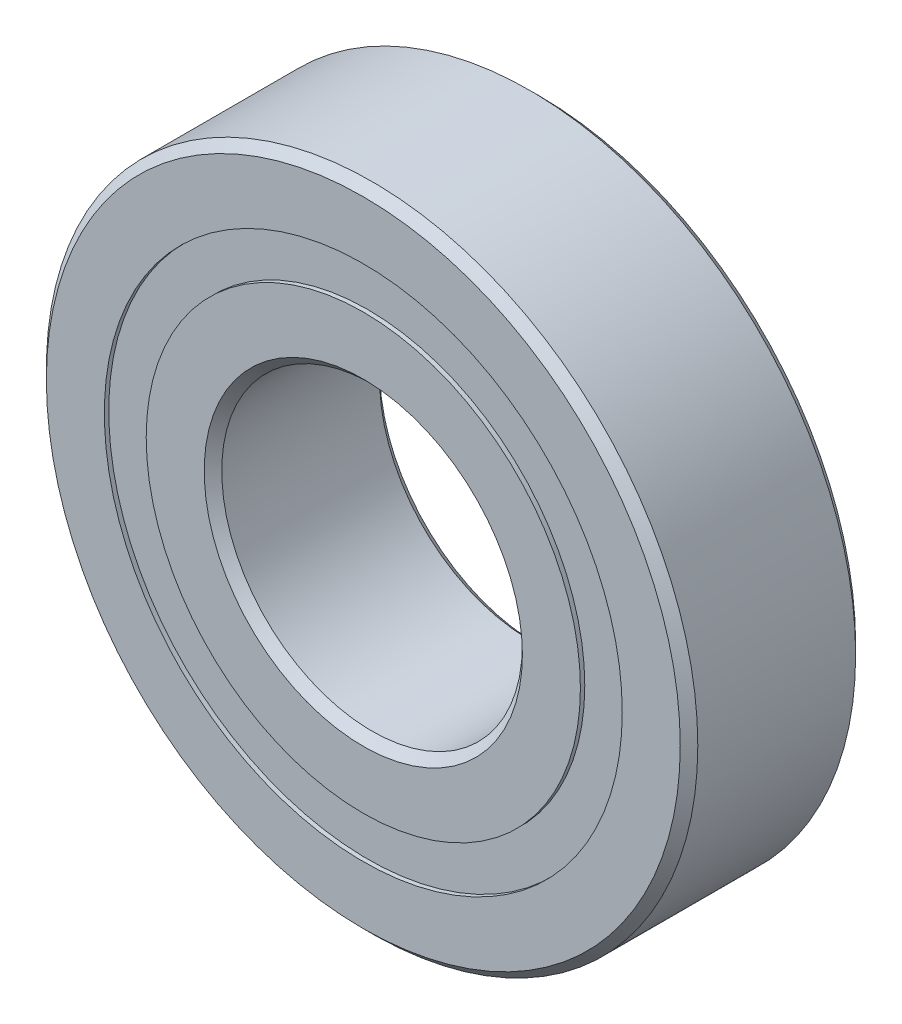
ISO-10303-21;
HEADER;
FILE_DESCRIPTION(('STEP AP214'),'2;1');
FILE_NAME('part.step','',(''),(''),'','','');
FILE_SCHEMA(('AUTOMOTIVE_DESIGN { 1 0 10303 214 1 1 1 1 }'));
ENDSEC;
DATA;
#1=APPLICATION_CONTEXT('core data for automotive mechanical design processes');
#2=APPLICATION_PROTOCOL_DEFINITION('international standard','automotive_design',2000,#1);
#3=PRODUCT_CONTEXT('',#1,'mechanical');
#4=PRODUCT('Part','Part','',(#3));
#5=PRODUCT_RELATED_PRODUCT_CATEGORY('part','',(#4));
#6=PRODUCT_DEFINITION_FORMATION('','',#4);
#7=PRODUCT_DEFINITION_CONTEXT('part definition',#1,'design');
#8=PRODUCT_DEFINITION('design','',#6,#7);
#9=PRODUCT_DEFINITION_SHAPE('','',#8);
#10=(LENGTH_UNIT() NAMED_UNIT(*) SI_UNIT(.MILLI.,.METRE.));
#11=(NAMED_UNIT(*) PLANE_ANGLE_UNIT() SI_UNIT($,.RADIAN.));
#12=(NAMED_UNIT(*) SI_UNIT($,.STERADIAN.) SOLID_ANGLE_UNIT());
#13=UNCERTAINTY_MEASURE_WITH_UNIT(LENGTH_MEASURE(1.E-05),#10,'distance_accuracy_value','');
#14=(GEOMETRIC_REPRESENTATION_CONTEXT(3) GLOBAL_UNCERTAINTY_ASSIGNED_CONTEXT((#13)) GLOBAL_UNIT_ASSIGNED_CONTEXT((#10,
#11,#12)) REPRESENTATION_CONTEXT('',''));
#15=CARTESIAN_POINT('',(0.,0.,0.));
#16=DIRECTION('',(0.,0.,1.));
#17=DIRECTION('',(1.,0.,0.));
#18=AXIS2_PLACEMENT_3D('',#15,#16,#17);
#19=CARTESIAN_POINT('',(0.,16.4070741758242,-5.2784375));
#20=DIRECTION('',(0.,0.,1.));
#21=DIRECTION('',(1.,0.,0.));
#22=AXIS2_PLACEMENT_3D('',#19,#20,#21);
#23=PLANE('',#22);
#24=CARTESIAN_POINT('',(0.,0.,-5.2784375));
#25=DIRECTION('',(0.,0.,1.));
#26=DIRECTION('',(1.,0.,0.));
#27=AXIS2_PLACEMENT_3D('',#24,#25,#26);
#28=CIRCLE('',#27,16.4070741758242);
#29=CARTESIAN_POINT('',(16.4070741758242,0.,-5.2784375));
#30=VERTEX_POINT('',#29);
#31=EDGE_CURVE('E55',#30,#30,#28,.T.);
#32=ORIENTED_EDGE('',*,*,#31,.F.);
#33=EDGE_LOOP('',(#32));
#34=FACE_BOUND('',#33,.T.);
#35=CARTESIAN_POINT('',(0.,0.,-5.2784375));
#36=DIRECTION('',(0.,0.,1.));
#37=DIRECTION('',(1.,0.,0.));
#38=AXIS2_PLACEMENT_3D('',#35,#36,#37);
#39=CIRCLE('',#38,13.7554258241758);
#40=CARTESIAN_POINT('',(13.7554258241758,0.,-5.2784375));
#41=VERTEX_POINT('',#40);
#42=EDGE_CURVE('E11',#41,#41,#39,.T.);
#43=ORIENTED_EDGE('',*,*,#42,.T.);
#44=EDGE_LOOP('',(#43));
#45=FACE_BOUND('',#44,.T.);
#46=ADVANCED_FACE('F41',(#34,#45),#23,.F.);
#47=CARTESIAN_POINT('',(0.,0.,5.55625));
#48=DIRECTION('',(0.,0.,1.));
#49=DIRECTION('',(1.,0.,0.));
#50=AXIS2_PLACEMENT_3D('',#47,#48,#49);
#51=CYLINDRICAL_SURFACE('',#50,13.7554258241758);
#52=ORIENTED_EDGE('',*,*,#42,.F.);
#53=EDGE_LOOP('',(#52));
#54=FACE_BOUND('',#53,.T.);
#55=CARTESIAN_POINT('',(0.,0.,-2.80284955168796));
#56=DIRECTION('',(0.,0.,1.));
#57=DIRECTION('',(1.,0.,0.));
#58=AXIS2_PLACEMENT_3D('',#55,#56,#57);
#59=CIRCLE('',#58,13.7554258241758);
#60=CARTESIAN_POINT('',(13.7554258241758,0.,-2.80284955168796));
#61=VERTEX_POINT('',#60);
#62=EDGE_CURVE('E47',#61,#61,#59,.T.);
#63=ORIENTED_EDGE('',*,*,#62,.T.);
#64=EDGE_LOOP('',(#63));
#65=FACE_BOUND('',#64,.T.);
#66=ADVANCED_FACE('F64',(#54,#65),#51,.F.);
#67=CARTESIAN_POINT('',(0.,16.4070741758242,-2.80284955168796));
#68=DIRECTION('',(0.,0.,-1.));
#69=DIRECTION('',(-1.,0.,0.));
#70=AXIS2_PLACEMENT_3D('',#67,#68,#69);
#71=PLANE('',#70);
#72=ORIENTED_EDGE('',*,*,#62,.F.);
#73=EDGE_LOOP('',(#72));
#74=FACE_BOUND('',#73,.T.);
#75=CARTESIAN_POINT('',(0.,0.,-2.80284955168796));
#76=DIRECTION('',(0.,0.,1.));
#77=DIRECTION('',(1.,0.,0.));
#78=AXIS2_PLACEMENT_3D('',#75,#76,#77);
#79=CIRCLE('',#78,16.4070741758242);
#80=CARTESIAN_POINT('',(16.4070741758242,0.,-2.80284955168796));
#81=VERTEX_POINT('',#80);
#82=EDGE_CURVE('E51',#81,#81,#79,.T.);
#83=ORIENTED_EDGE('',*,*,#82,.T.);
#84=EDGE_LOOP('',(#83));
#85=FACE_BOUND('',#84,.T.);
#86=ADVANCED_FACE('F68',(#74,#85),#71,.F.);
#87=CARTESIAN_POINT('',(0.,0.,5.55625));
#88=DIRECTION('',(0.,0.,1.));
#89=DIRECTION('',(1.,0.,0.));
#90=AXIS2_PLACEMENT_3D('',#87,#88,#89);
#91=CYLINDRICAL_SURFACE('',#90,16.4070741758242);
#92=ORIENTED_EDGE('',*,*,#82,.F.);
#93=EDGE_LOOP('',(#92));
#94=FACE_BOUND('',#93,.T.);
#95=ORIENTED_EDGE('',*,*,#31,.T.);
#96=EDGE_LOOP('',(#95));
#97=FACE_BOUND('',#96,.T.);
#98=ADVANCED_FACE('F61',(#94,#97),#91,.T.);
#99=CLOSED_SHELL('',(#46,#66,#86,#98));
#100=MANIFOLD_SOLID_BREP('B2',#99);
#101=CARTESIAN_POINT('',(0.,16.4070741758242,5.2784375));
#102=DIRECTION('',(0.,0.,-1.));
#103=DIRECTION('',(-1.,0.,0.));
#104=AXIS2_PLACEMENT_3D('',#101,#102,#103);
#105=PLANE('',#104);
#106=CARTESIAN_POINT('',(0.,0.,5.2784375));
#107=DIRECTION('',(0.,0.,1.));
#108=DIRECTION('',(1.,0.,0.));
#109=AXIS2_PLACEMENT_3D('',#106,#107,#108);
#110=CIRCLE('',#109,13.7554258241758);
#111=CARTESIAN_POINT('',(13.7554258241758,0.,5.2784375));
#112=VERTEX_POINT('',#111);
#113=EDGE_CURVE('E40',#112,#112,#110,.T.);
#114=ORIENTED_EDGE('',*,*,#113,.F.);
#115=EDGE_LOOP('',(#114));
#116=FACE_BOUND('',#115,.T.);
#117=CARTESIAN_POINT('',(0.,0.,5.2784375));
#118=DIRECTION('',(0.,0.,1.));
#119=DIRECTION('',(1.,0.,0.));
#120=AXIS2_PLACEMENT_3D('',#117,#118,#119);
#121=CIRCLE('',#120,16.4070741758242);
#122=CARTESIAN_POINT('',(16.4070741758242,0.,5.2784375));
#123=VERTEX_POINT('',#122);
#124=EDGE_CURVE('E122',#123,#123,#121,.T.);
#125=ORIENTED_EDGE('',*,*,#124,.T.);
#126=EDGE_LOOP('',(#125));
#127=FACE_BOUND('',#126,.T.);
#128=ADVANCED_FACE('F108',(#116,#127),#105,.F.);
#129=CARTESIAN_POINT('',(0.,0.,5.55625));
#130=DIRECTION('',(0.,0.,1.));
#131=DIRECTION('',(1.,0.,0.));
#132=AXIS2_PLACEMENT_3D('',#129,#130,#131);
#133=CYLINDRICAL_SURFACE('',#132,13.7554258241758);
#134=CARTESIAN_POINT('',(0.,0.,2.80284955168796));
#135=DIRECTION('',(0.,0.,1.));
#136=DIRECTION('',(1.,0.,0.));
#137=AXIS2_PLACEMENT_3D('',#134,#135,#136);
#138=CIRCLE('',#137,13.7554258241758);
#139=CARTESIAN_POINT('',(13.7554258241758,0.,2.80284955168796));
#140=VERTEX_POINT('',#139);
#141=EDGE_CURVE('E114',#140,#140,#138,.T.);
#142=ORIENTED_EDGE('',*,*,#141,.F.);
#143=EDGE_LOOP('',(#142));
#144=FACE_BOUND('',#143,.T.);
#145=ORIENTED_EDGE('',*,*,#113,.T.);
#146=EDGE_LOOP('',(#145));
#147=FACE_BOUND('',#146,.T.);
#148=ADVANCED_FACE('F137',(#144,#147),#133,.F.);
#149=CARTESIAN_POINT('',(0.,16.4070741758242,2.80284955168796));
#150=DIRECTION('',(0.,0.,1.));
#151=DIRECTION('',(1.,0.,0.));
#152=AXIS2_PLACEMENT_3D('',#149,#150,#151);
#153=PLANE('',#152);
#154=CARTESIAN_POINT('',(0.,0.,2.80284955168796));
#155=DIRECTION('',(0.,0.,1.));
#156=DIRECTION('',(1.,0.,0.));
#157=AXIS2_PLACEMENT_3D('',#154,#155,#156);
#158=CIRCLE('',#157,16.4070741758242);
#159=CARTESIAN_POINT('',(16.4070741758242,0.,2.80284955168796));
#160=VERTEX_POINT('',#159);
#161=EDGE_CURVE('E118',#160,#160,#158,.T.);
#162=ORIENTED_EDGE('',*,*,#161,.F.);
#163=EDGE_LOOP('',(#162));
#164=FACE_BOUND('',#163,.T.);
#165=ORIENTED_EDGE('',*,*,#141,.T.);
#166=EDGE_LOOP('',(#165));
#167=FACE_BOUND('',#166,.T.);
#168=ADVANCED_FACE('F132',(#164,#167),#153,.F.);
#169=CARTESIAN_POINT('',(0.,0.,5.55625));
#170=DIRECTION('',(0.,0.,1.));
#171=DIRECTION('',(1.,0.,0.));
#172=AXIS2_PLACEMENT_3D('',#169,#170,#171);
#173=CYLINDRICAL_SURFACE('',#172,16.4070741758242);
#174=ORIENTED_EDGE('',*,*,#124,.F.);
#175=EDGE_LOOP('',(#174));
#176=FACE_BOUND('',#175,.T.);
#177=ORIENTED_EDGE('',*,*,#161,.T.);
#178=EDGE_LOOP('',(#177));
#179=FACE_BOUND('',#178,.T.);
#180=ADVANCED_FACE('F129',(#176,#179),#173,.T.);
#181=CLOSED_SHELL('',(#128,#148,#168,#180));
#182=MANIFOLD_SOLID_BREP('B6',#181);
#183=CARTESIAN_POINT('',(-8.8645363361357,12.2009875464173,0.));
#184=DIRECTION('',(0.,0.,1.));
#185=DIRECTION('',(-0.587785252292462,0.809016994374955,0.));
#186=AXIS2_PLACEMENT_3D('',#183,#184,#185);
#187=SPHERICAL_SURFACE('',#186,2.80284955168796);
#188=CARTESIAN_POINT('',(-8.8645363361357,12.2009875464173,2.80284955168796));
#189=VERTEX_POINT('',#188);
#190=VERTEX_LOOP('',#189);
#191=FACE_BOUND('',#190,.T.);
#192=ADVANCED_FACE('F175',(#191),#187,.T.);
#193=CLOSED_SHELL('',(#192));
#194=MANIFOLD_SOLID_BREP('B35',#193);
#195=CARTESIAN_POINT('',(-14.3431210863762,4.66036254641734,0.));
#196=DIRECTION('',(0.,0.,1.));
#197=DIRECTION('',(-0.95105651629515,0.309016994374958,0.));
#198=AXIS2_PLACEMENT_3D('',#195,#196,#197);
#199=SPHERICAL_SURFACE('',#198,2.80284955168796);
#200=CARTESIAN_POINT('',(-14.3431210863762,4.66036254641734,2.80284955168796));
#201=VERTEX_POINT('',#200);
#202=VERTEX_LOOP('',#201);
#203=FACE_BOUND('',#202,.T.);
#204=ADVANCED_FACE('F195',(#203),#199,.T.);
#205=CLOSED_SHELL('',(#204));
#206=MANIFOLD_SOLID_BREP('B104',#205);
#207=CARTESIAN_POINT('',(-14.3431210863763,-4.66036254641704,0.));
#208=DIRECTION('',(0.,0.,1.));
#209=DIRECTION('',(-0.951056516295157,-0.309016994374938,0.));
#210=AXIS2_PLACEMENT_3D('',#207,#208,#209);
#211=SPHERICAL_SURFACE('',#210,2.80284955168796);
#212=CARTESIAN_POINT('',(-14.3431210863763,-4.66036254641704,2.80284955168796));
#213=VERTEX_POINT('',#212);
#214=VERTEX_LOOP('',#213);
#215=FACE_BOUND('',#214,.T.);
#216=ADVANCED_FACE('F215',(#215),#211,.T.);
#217=CLOSED_SHELL('',(#216));
#218=MANIFOLD_SOLID_BREP('B171',#217);
#219=CARTESIAN_POINT('',(-8.86453633613597,-12.2009875464171,0.));
#220=DIRECTION('',(0.,0.,1.));
#221=DIRECTION('',(-0.58778525229248,-0.809016994374942,0.));
#222=AXIS2_PLACEMENT_3D('',#219,#220,#221);
#223=SPHERICAL_SURFACE('',#222,2.80284955168796);
#224=CARTESIAN_POINT('',(-8.86453633613597,-12.2009875464171,2.80284955168796));
#225=VERTEX_POINT('',#224);
#226=VERTEX_LOOP('',#225);
#227=FACE_BOUND('',#226,.T.);
#228=ADVANCED_FACE('F235',(#227),#223,.T.);
#229=CLOSED_SHELL('',(#228));
#230=MANIFOLD_SOLID_BREP('B191',#229);
#231=CARTESIAN_POINT('',(-1.05311866879462E-13,-15.08125,0.));
#232=DIRECTION('',(0.,0.,1.));
#233=DIRECTION('',(0.,-1.,0.));
#234=AXIS2_PLACEMENT_3D('',#231,#232,#233);
#235=SPHERICAL_SURFACE('',#234,2.80284955168796);
#236=CARTESIAN_POINT('',(-1.05311866879462E-13,-15.08125,2.80284955168796));
#237=VERTEX_POINT('',#236);
#238=VERTEX_LOOP('',#237);
#239=FACE_BOUND('',#238,.T.);
#240=ADVANCED_FACE('F255',(#239),#235,.T.);
#241=CLOSED_SHELL('',(#240));
#242=MANIFOLD_SOLID_BREP('B211',#241);
#243=CARTESIAN_POINT('',(8.86453633613579,-12.2009875464172,0.));
#244=DIRECTION('',(0.,0.,1.));
#245=DIRECTION('',(0.587785252292469,-0.809016994374951,0.));
#246=AXIS2_PLACEMENT_3D('',#243,#244,#245);
#247=SPHERICAL_SURFACE('',#246,2.80284955168796);
#248=CARTESIAN_POINT('',(8.86453633613579,-12.2009875464172,2.80284955168796));
#249=VERTEX_POINT('',#248);
#250=VERTEX_LOOP('',#249);
#251=FACE_BOUND('',#250,.T.);
#252=ADVANCED_FACE('F275',(#251),#247,.T.);
#253=CLOSED_SHELL('',(#252));
#254=MANIFOLD_SOLID_BREP('B231',#253);
#255=CARTESIAN_POINT('',(14.3431210863763,-4.66036254641724,0.));
#256=DIRECTION('',(0.,0.,1.));
#257=DIRECTION('',(0.951056516295152,-0.309016994374952,0.));
#258=AXIS2_PLACEMENT_3D('',#255,#256,#257);
#259=SPHERICAL_SURFACE('',#258,2.80284955168796);
#260=CARTESIAN_POINT('',(14.3431210863763,-4.66036254641724,2.80284955168796));
#261=VERTEX_POINT('',#260);
#262=VERTEX_LOOP('',#261);
#263=FACE_BOUND('',#262,.T.);
#264=ADVANCED_FACE('F295',(#263),#259,.T.);
#265=CLOSED_SHELL('',(#264));
#266=MANIFOLD_SOLID_BREP('B251',#265);
#267=CARTESIAN_POINT('',(14.3431210863763,4.66036254641714,0.));
#268=DIRECTION('',(0.,0.,1.));
#269=DIRECTION('',(0.951056516295155,0.309016994374945,0.));
#270=AXIS2_PLACEMENT_3D('',#267,#268,#269);
#271=SPHERICAL_SURFACE('',#270,2.80284955168796);
#272=CARTESIAN_POINT('',(14.3431210863763,4.66036254641714,2.80284955168796));
#273=VERTEX_POINT('',#272);
#274=VERTEX_LOOP('',#273);
#275=FACE_BOUND('',#274,.T.);
#276=ADVANCED_FACE('F315',(#275),#271,.T.);
#277=CLOSED_SHELL('',(#276));
#278=MANIFOLD_SOLID_BREP('B271',#277);
#279=CARTESIAN_POINT('',(8.86453633613588,12.2009875464172,0.));
#280=DIRECTION('',(0.,0.,1.));
#281=DIRECTION('',(0.587785252292474,0.809016994374947,0.));
#282=AXIS2_PLACEMENT_3D('',#279,#280,#281);
#283=SPHERICAL_SURFACE('',#282,2.80284955168796);
#284=CARTESIAN_POINT('',(8.86453633613588,12.2009875464172,2.80284955168796));
#285=VERTEX_POINT('',#284);
#286=VERTEX_LOOP('',#285);
#287=FACE_BOUND('',#286,.T.);
#288=ADVANCED_FACE('F335',(#287),#283,.T.);
#289=CLOSED_SHELL('',(#288));
#290=MANIFOLD_SOLID_BREP('B291',#289);
#291=CARTESIAN_POINT('',(0.,15.08125,0.));
#292=DIRECTION('',(0.,0.,1.));
#293=DIRECTION('',(0.,1.,0.));
#294=AXIS2_PLACEMENT_3D('',#291,#292,#293);
#295=SPHERICAL_SURFACE('',#294,2.80284955168796);
#296=CARTESIAN_POINT('',(0.,15.08125,2.80284955168796));
#297=VERTEX_POINT('',#296);
#298=VERTEX_LOOP('',#297);
#299=FACE_BOUND('',#298,.T.);
#300=ADVANCED_FACE('F357',(#299),#295,.T.);
#301=CLOSED_SHELL('',(#300));
#302=MANIFOLD_SOLID_BREP('B311',#301);
#303=CARTESIAN_POINT('',(0.,13.7554258241758,5.55625));
#304=DIRECTION('',(0.,0.,-1.));
#305=DIRECTION('',(-1.,0.,0.));
#306=AXIS2_PLACEMENT_3D('',#303,#304,#305);
#307=PLANE('',#306);
#308=CARTESIAN_POINT('',(0.,0.,5.55625));
#309=DIRECTION('',(0.,0.,1.));
#310=DIRECTION('',(1.,0.,0.));
#311=AXIS2_PLACEMENT_3D('',#308,#309,#310);
#312=CIRCLE('',#311,10.080625);
#313=CARTESIAN_POINT('',(10.080625,0.,5.55625));
#314=VERTEX_POINT('',#313);
#315=EDGE_CURVE('E404',#314,#314,#312,.T.);
#316=ORIENTED_EDGE('',*,*,#315,.F.);
#317=EDGE_LOOP('',(#316));
#318=FACE_BOUND('',#317,.T.);
#319=CARTESIAN_POINT('',(0.,0.,5.55625000000001));
#320=DIRECTION('',(0.,0.,1.));
#321=DIRECTION('',(1.,0.,0.));
#322=AXIS2_PLACEMENT_3D('',#319,#320,#321);
#323=CIRCLE('',#322,13.7554258241758);
#324=CARTESIAN_POINT('',(13.7554258241758,0.,5.55625000000001));
#325=VERTEX_POINT('',#324);
#326=EDGE_CURVE('E356',#325,#325,#323,.T.);
#327=ORIENTED_EDGE('',*,*,#326,.T.);
#328=EDGE_LOOP('',(#327));
#329=FACE_BOUND('',#328,.T.);
#330=ADVANCED_FACE('F376',(#318,#329),#307,.F.);
#331=CARTESIAN_POINT('',(0.,0.,5.55625));
#332=DIRECTION('',(0.,0.,1.));
#333=DIRECTION('',(1.,0.,0.));
#334=AXIS2_PLACEMENT_3D('',#331,#332,#333);
#335=CYLINDRICAL_SURFACE('',#334,13.7554258241758);
#336=ORIENTED_EDGE('',*,*,#326,.F.);
#337=EDGE_LOOP('',(#336));
#338=FACE_BOUND('',#337,.T.);
#339=CARTESIAN_POINT('',(0.,0.,2.46944444444444));
#340=DIRECTION('',(0.,0.,1.));
#341=DIRECTION('',(1.,0.,0.));
#342=AXIS2_PLACEMENT_3D('',#339,#340,#341);
#343=CIRCLE('',#342,13.7554258241758);
#344=CARTESIAN_POINT('',(13.7554258241758,0.,2.46944444444444));
#345=VERTEX_POINT('',#344);
#346=EDGE_CURVE('E382',#345,#345,#343,.T.);
#347=ORIENTED_EDGE('',*,*,#346,.T.);
#348=EDGE_LOOP('',(#347));
#349=FACE_BOUND('',#348,.T.);
#350=ADVANCED_FACE('F411',(#338,#349),#335,.T.);
#351=CARTESIAN_POINT('',(0.,0.,0.));
#352=DIRECTION('',(0.,0.,1.));
#353=DIRECTION('',(1.,0.,0.));
#354=AXIS2_PLACEMENT_3D('',#351,#352,#353);
#355=TOROIDAL_SURFACE('',#354,15.08125,2.80284955168795);
#356=ORIENTED_EDGE('',*,*,#346,.F.);
#357=EDGE_LOOP('',(#356));
#358=FACE_BOUND('',#357,.T.);
#359=CARTESIAN_POINT('',(0.,0.,-2.46944444444445));
#360=DIRECTION('',(0.,0.,1.));
#361=DIRECTION('',(1.,0.,0.));
#362=AXIS2_PLACEMENT_3D('',#359,#360,#361);
#363=CIRCLE('',#362,13.7554258241758);
#364=CARTESIAN_POINT('',(13.7554258241758,0.,-2.46944444444445));
#365=VERTEX_POINT('',#364);
#366=EDGE_CURVE('E386',#365,#365,#363,.T.);
#367=ORIENTED_EDGE('',*,*,#366,.T.);
#368=EDGE_LOOP('',(#367));
#369=FACE_BOUND('',#368,.T.);
#370=ADVANCED_FACE('F415',(#358,#369),#355,.F.);
#371=CARTESIAN_POINT('',(0.,0.,5.55625));
#372=DIRECTION('',(0.,0.,1.));
#373=DIRECTION('',(1.,0.,0.));
#374=AXIS2_PLACEMENT_3D('',#371,#372,#373);
#375=CYLINDRICAL_SURFACE('',#374,13.7554258241758);
#376=ORIENTED_EDGE('',*,*,#366,.F.);
#377=EDGE_LOOP('',(#376));
#378=FACE_BOUND('',#377,.T.);
#379=CARTESIAN_POINT('',(0.,0.,-5.55625));
#380=DIRECTION('',(0.,0.,1.));
#381=DIRECTION('',(1.,0.,0.));
#382=AXIS2_PLACEMENT_3D('',#379,#380,#381);
#383=CIRCLE('',#382,13.7554258241758);
#384=CARTESIAN_POINT('',(13.7554258241758,0.,-5.55625));
#385=VERTEX_POINT('',#384);
#386=EDGE_CURVE('E390',#385,#385,#383,.T.);
#387=ORIENTED_EDGE('',*,*,#386,.T.);
#388=EDGE_LOOP('',(#387));
#389=FACE_BOUND('',#388,.T.);
#390=ADVANCED_FACE('F420',(#378,#389),#375,.T.);
#391=CARTESIAN_POINT('',(0.,10.080625,-5.55625000000001));
#392=DIRECTION('',(0.,0.,1.));
#393=DIRECTION('',(1.,0.,0.));
#394=AXIS2_PLACEMENT_3D('',#391,#392,#393);
#395=PLANE('',#394);
#396=ORIENTED_EDGE('',*,*,#386,.F.);
#397=EDGE_LOOP('',(#396));
#398=FACE_BOUND('',#397,.T.);
#399=CARTESIAN_POINT('',(0.,0.,-5.55625));
#400=DIRECTION('',(0.,0.,1.));
#401=DIRECTION('',(1.,0.,0.));
#402=AXIS2_PLACEMENT_3D('',#399,#400,#401);
#403=CIRCLE('',#402,10.080625);
#404=CARTESIAN_POINT('',(10.080625,0.,-5.55625));
#405=VERTEX_POINT('',#404);
#406=EDGE_CURVE('E395',#405,#405,#403,.T.);
#407=ORIENTED_EDGE('',*,*,#406,.T.);
#408=EDGE_LOOP('',(#407));
#409=FACE_BOUND('',#408,.T.);
#410=ADVANCED_FACE('F426',(#398,#409),#395,.F.);
#411=CARTESIAN_POINT('',(0.,0.,-5.000625));
#412=DIRECTION('',(0.,0.,-1.));
#413=DIRECTION('',(-1.,0.,0.));
#414=AXIS2_PLACEMENT_3D('',#411,#412,#413);
#415=CONICAL_SURFACE('',#414,9.525,0.785398163397447);
#416=ORIENTED_EDGE('',*,*,#406,.F.);
#417=EDGE_LOOP('',(#416));
#418=FACE_BOUND('',#417,.T.);
#419=CARTESIAN_POINT('',(0.,0.,-5.000625));
#420=DIRECTION('',(0.,0.,1.));
#421=DIRECTION('',(1.,0.,0.));
#422=AXIS2_PLACEMENT_3D('',#419,#420,#421);
#423=CIRCLE('',#422,9.525);
#424=CARTESIAN_POINT('',(9.525,0.,-5.000625));
#425=VERTEX_POINT('',#424);
#426=EDGE_CURVE('E398',#425,#425,#423,.T.);
#427=ORIENTED_EDGE('',*,*,#426,.T.);
#428=EDGE_LOOP('',(#427));
#429=FACE_BOUND('',#428,.T.);
#430=ADVANCED_FACE('F430',(#418,#429),#415,.F.);
#431=CARTESIAN_POINT('',(0.,0.,5.55625));
#432=DIRECTION('',(0.,0.,1.));
#433=DIRECTION('',(1.,0.,0.));
#434=AXIS2_PLACEMENT_3D('',#431,#432,#433);
#435=CYLINDRICAL_SURFACE('',#434,9.525);
#436=ORIENTED_EDGE('',*,*,#426,.F.);
#437=EDGE_LOOP('',(#436));
#438=FACE_BOUND('',#437,.T.);
#439=CARTESIAN_POINT('',(0.,0.,5.000625));
#440=DIRECTION('',(0.,0.,1.));
#441=DIRECTION('',(1.,0.,0.));
#442=AXIS2_PLACEMENT_3D('',#439,#440,#441);
#443=CIRCLE('',#442,9.525);
#444=CARTESIAN_POINT('',(9.525,0.,5.000625));
#445=VERTEX_POINT('',#444);
#446=EDGE_CURVE('E401',#445,#445,#443,.T.);
#447=ORIENTED_EDGE('',*,*,#446,.T.);
#448=EDGE_LOOP('',(#447));
#449=FACE_BOUND('',#448,.T.);
#450=ADVANCED_FACE('F434',(#438,#449),#435,.F.);
#451=CARTESIAN_POINT('',(0.,0.,5.55625));
#452=DIRECTION('',(0.,0.,1.));
#453=DIRECTION('',(1.,0.,0.));
#454=AXIS2_PLACEMENT_3D('',#451,#452,#453);
#455=CONICAL_SURFACE('',#454,10.080625,0.785398163397451);
#456=ORIENTED_EDGE('',*,*,#446,.F.);
#457=EDGE_LOOP('',(#456));
#458=FACE_BOUND('',#457,.T.);
#459=ORIENTED_EDGE('',*,*,#315,.T.);
#460=EDGE_LOOP('',(#459));
#461=FACE_BOUND('',#460,.T.);
#462=ADVANCED_FACE('F408',(#458,#461),#455,.F.);
#463=CLOSED_SHELL('',(#330,#350,#370,#390,#410,#430,#450,#462));
#464=MANIFOLD_SOLID_BREP('B331',#463);
#465=CARTESIAN_POINT('',(0.,0.,5.000625));
#466=DIRECTION('',(0.,0.,-1.));
#467=DIRECTION('',(-1.,0.,0.));
#468=AXIS2_PLACEMENT_3D('',#465,#466,#467);
#469=CONICAL_SURFACE('',#468,20.6375,0.785398163397449);
#470=CARTESIAN_POINT('',(0.,0.,5.55625));
#471=DIRECTION('',(0.,0.,1.));
#472=DIRECTION('',(1.,0.,0.));
#473=AXIS2_PLACEMENT_3D('',#470,#471,#472);
#474=CIRCLE('',#473,20.081875);
#475=CARTESIAN_POINT('',(20.081875,0.,5.55625));
#476=VERTEX_POINT('',#475);
#477=EDGE_CURVE('E525',#476,#476,#474,.T.);
#478=ORIENTED_EDGE('',*,*,#477,.F.);
#479=EDGE_LOOP('',(#478));
#480=FACE_BOUND('',#479,.T.);
#481=CARTESIAN_POINT('',(0.,0.,5.000625));
#482=DIRECTION('',(0.,0.,1.));
#483=DIRECTION('',(1.,0.,0.));
#484=AXIS2_PLACEMENT_3D('',#481,#482,#483);
#485=CIRCLE('',#484,20.6375);
#486=CARTESIAN_POINT('',(20.6375,0.,5.000625));
#487=VERTEX_POINT('',#486);
#488=EDGE_CURVE('E375',#487,#487,#485,.T.);
#489=ORIENTED_EDGE('',*,*,#488,.T.);
#490=EDGE_LOOP('',(#489));
#491=FACE_BOUND('',#490,.T.);
#492=ADVANCED_FACE('F497',(#480,#491),#469,.T.);
#493=CARTESIAN_POINT('',(0.,0.,5.55625));
#494=DIRECTION('',(0.,0.,1.));
#495=DIRECTION('',(1.,0.,0.));
#496=AXIS2_PLACEMENT_3D('',#493,#494,#495);
#497=CYLINDRICAL_SURFACE('',#496,20.6375);
#498=ORIENTED_EDGE('',*,*,#488,.F.);
#499=EDGE_LOOP('',(#498));
#500=FACE_BOUND('',#499,.T.);
#501=CARTESIAN_POINT('',(0.,0.,-5.000625));
#502=DIRECTION('',(0.,0.,1.));
#503=DIRECTION('',(1.,0.,0.));
#504=AXIS2_PLACEMENT_3D('',#501,#502,#503);
#505=CIRCLE('',#504,20.6375);
#506=CARTESIAN_POINT('',(20.6375,0.,-5.000625));
#507=VERTEX_POINT('',#506);
#508=EDGE_CURVE('E503',#507,#507,#505,.T.);
#509=ORIENTED_EDGE('',*,*,#508,.T.);
#510=EDGE_LOOP('',(#509));
#511=FACE_BOUND('',#510,.T.);
#512=ADVANCED_FACE('F532',(#500,#511),#497,.T.);
#513=CARTESIAN_POINT('',(0.,0.,-5.55625));
#514=DIRECTION('',(0.,0.,1.));
#515=DIRECTION('',(1.,0.,0.));
#516=AXIS2_PLACEMENT_3D('',#513,#514,#515);
#517=CONICAL_SURFACE('',#516,20.081875,0.785398163397448);
#518=ORIENTED_EDGE('',*,*,#508,.F.);
#519=EDGE_LOOP('',(#518));
#520=FACE_BOUND('',#519,.T.);
#521=CARTESIAN_POINT('',(0.,0.,-5.55625));
#522=DIRECTION('',(0.,0.,1.));
#523=DIRECTION('',(1.,0.,0.));
#524=AXIS2_PLACEMENT_3D('',#521,#522,#523);
#525=CIRCLE('',#524,20.081875);
#526=CARTESIAN_POINT('',(20.081875,0.,-5.55625));
#527=VERTEX_POINT('',#526);
#528=EDGE_CURVE('E507',#527,#527,#525,.T.);
#529=ORIENTED_EDGE('',*,*,#528,.T.);
#530=EDGE_LOOP('',(#529));
#531=FACE_BOUND('',#530,.T.);
#532=ADVANCED_FACE('F536',(#520,#531),#517,.T.);
#533=CARTESIAN_POINT('',(0.,20.081875,-5.55625));
#534=DIRECTION('',(0.,0.,1.));
#535=DIRECTION('',(1.,0.,0.));
#536=AXIS2_PLACEMENT_3D('',#533,#534,#535);
#537=PLANE('',#536);
#538=ORIENTED_EDGE('',*,*,#528,.F.);
#539=EDGE_LOOP('',(#538));
#540=FACE_BOUND('',#539,.T.);
#541=CARTESIAN_POINT('',(0.,0.,-5.55625));
#542=DIRECTION('',(0.,0.,1.));
#543=DIRECTION('',(1.,0.,0.));
#544=AXIS2_PLACEMENT_3D('',#541,#542,#543);
#545=CIRCLE('',#544,16.4070741758242);
#546=CARTESIAN_POINT('',(16.4070741758242,0.,-5.55625));
#547=VERTEX_POINT('',#546);
#548=EDGE_CURVE('E511',#547,#547,#545,.T.);
#549=ORIENTED_EDGE('',*,*,#548,.T.);
#550=EDGE_LOOP('',(#549));
#551=FACE_BOUND('',#550,.T.);
#552=ADVANCED_FACE('F541',(#540,#551),#537,.F.);
#553=CARTESIAN_POINT('',(0.,0.,5.55625));
#554=DIRECTION('',(0.,0.,1.));
#555=DIRECTION('',(1.,0.,0.));
#556=AXIS2_PLACEMENT_3D('',#553,#554,#555);
#557=CYLINDRICAL_SURFACE('',#556,16.4070741758242);
#558=ORIENTED_EDGE('',*,*,#548,.F.);
#559=EDGE_LOOP('',(#558));
#560=FACE_BOUND('',#559,.T.);
#561=CARTESIAN_POINT('',(0.,0.,-2.46944444444444));
#562=DIRECTION('',(0.,0.,1.));
#563=DIRECTION('',(1.,0.,0.));
#564=AXIS2_PLACEMENT_3D('',#561,#562,#563);
#565=CIRCLE('',#564,16.4070741758242);
#566=CARTESIAN_POINT('',(16.4070741758242,0.,-2.46944444444444));
#567=VERTEX_POINT('',#566);
#568=EDGE_CURVE('E516',#567,#567,#565,.T.);
#569=ORIENTED_EDGE('',*,*,#568,.T.);
#570=EDGE_LOOP('',(#569));
#571=FACE_BOUND('',#570,.T.);
#572=ADVANCED_FACE('F547',(#560,#571),#557,.F.);
#573=CARTESIAN_POINT('',(0.,0.,0.));
#574=DIRECTION('',(0.,0.,1.));
#575=DIRECTION('',(1.,0.,0.));
#576=AXIS2_PLACEMENT_3D('',#573,#574,#575);
#577=TOROIDAL_SURFACE('',#576,15.08125,2.80284955168796);
#578=ORIENTED_EDGE('',*,*,#568,.F.);
#579=EDGE_LOOP('',(#578));
#580=FACE_BOUND('',#579,.T.);
#581=CARTESIAN_POINT('',(0.,0.,2.46944444444444));
#582=DIRECTION('',(0.,0.,1.));
#583=DIRECTION('',(1.,0.,0.));
#584=AXIS2_PLACEMENT_3D('',#581,#582,#583);
#585=CIRCLE('',#584,16.4070741758242);
#586=CARTESIAN_POINT('',(16.4070741758242,0.,2.46944444444444));
#587=VERTEX_POINT('',#586);
#588=EDGE_CURVE('E519',#587,#587,#585,.T.);
#589=ORIENTED_EDGE('',*,*,#588,.T.);
#590=EDGE_LOOP('',(#589));
#591=FACE_BOUND('',#590,.T.);
#592=ADVANCED_FACE('F551',(#580,#591),#577,.F.);
#593=CARTESIAN_POINT('',(0.,0.,5.55625));
#594=DIRECTION('',(0.,0.,1.));
#595=DIRECTION('',(1.,0.,0.));
#596=AXIS2_PLACEMENT_3D('',#593,#594,#595);
#597=CYLINDRICAL_SURFACE('',#596,16.4070741758242);
#598=ORIENTED_EDGE('',*,*,#588,.F.);
#599=EDGE_LOOP('',(#598));
#600=FACE_BOUND('',#599,.T.);
#601=CARTESIAN_POINT('',(0.,0.,5.55625));
#602=DIRECTION('',(0.,0.,1.));
#603=DIRECTION('',(1.,0.,0.));
#604=AXIS2_PLACEMENT_3D('',#601,#602,#603);
#605=CIRCLE('',#604,16.4070741758242);
#606=CARTESIAN_POINT('',(16.4070741758242,0.,5.55625));
#607=VERTEX_POINT('',#606);
#608=EDGE_CURVE('E522',#607,#607,#605,.T.);
#609=ORIENTED_EDGE('',*,*,#608,.T.);
#610=EDGE_LOOP('',(#609));
#611=FACE_BOUND('',#610,.T.);
#612=ADVANCED_FACE('F555',(#600,#611),#597,.F.);
#613=CARTESIAN_POINT('',(0.,20.081875,5.55625));
#614=DIRECTION('',(0.,0.,-1.));
#615=DIRECTION('',(-1.,0.,0.));
#616=AXIS2_PLACEMENT_3D('',#613,#614,#615);
#617=PLANE('',#616);
#618=ORIENTED_EDGE('',*,*,#608,.F.);
#619=EDGE_LOOP('',(#618));
#620=FACE_BOUND('',#619,.T.);
#621=ORIENTED_EDGE('',*,*,#477,.T.);
#622=EDGE_LOOP('',(#621));
#623=FACE_BOUND('',#622,.T.);
#624=ADVANCED_FACE('F529',(#620,#623),#617,.F.);
#625=CLOSED_SHELL('',(#492,#512,#532,#552,#572,#592,#612,#624));
#626=MANIFOLD_SOLID_BREP('B351',#625);
#627=ADVANCED_BREP_SHAPE_REPRESENTATION('',(#18,#100,#182,#194,#206,#218,#230,#242,#254,#266,
#278,#290,#302,#464,#626),#14);
#628=SHAPE_DEFINITION_REPRESENTATION(#9,#627);
ENDSEC;
END-ISO-10303-21;
